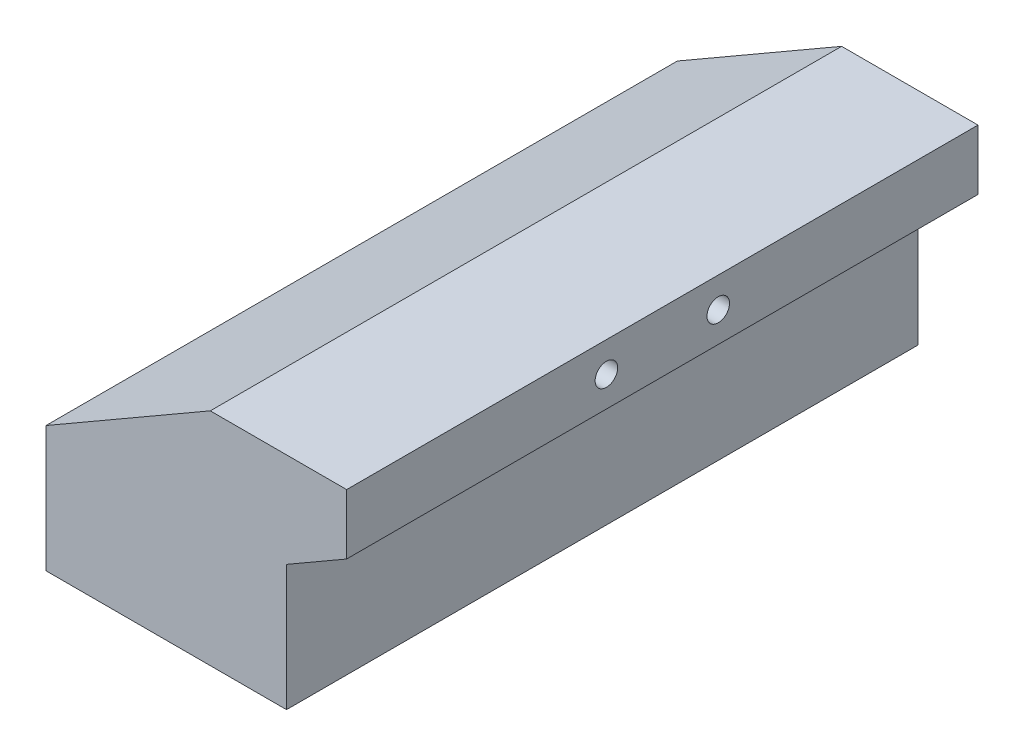
ISO-10303-21;
HEADER;
FILE_DESCRIPTION(('STEP AP214'),'2;1');
FILE_NAME('part.step','',(''),(''),'','','');
FILE_SCHEMA(('AUTOMOTIVE_DESIGN { 1 0 10303 214 1 1 1 1 }'));
ENDSEC;
DATA;
#1=APPLICATION_CONTEXT('core data for automotive mechanical design processes');
#2=APPLICATION_PROTOCOL_DEFINITION('international standard','automotive_design',2000,#1);
#3=PRODUCT_CONTEXT('',#1,'mechanical');
#4=PRODUCT('Part','Part','',(#3));
#5=PRODUCT_RELATED_PRODUCT_CATEGORY('part','',(#4));
#6=PRODUCT_DEFINITION_FORMATION('','',#4);
#7=PRODUCT_DEFINITION_CONTEXT('part definition',#1,'design');
#8=PRODUCT_DEFINITION('design','',#6,#7);
#9=PRODUCT_DEFINITION_SHAPE('','',#8);
#10=(LENGTH_UNIT() NAMED_UNIT(*) SI_UNIT(.MILLI.,.METRE.));
#11=(NAMED_UNIT(*) PLANE_ANGLE_UNIT() SI_UNIT($,.RADIAN.));
#12=(NAMED_UNIT(*) SI_UNIT($,.STERADIAN.) SOLID_ANGLE_UNIT());
#13=UNCERTAINTY_MEASURE_WITH_UNIT(LENGTH_MEASURE(1.E-05),#10,'distance_accuracy_value','');
#14=(GEOMETRIC_REPRESENTATION_CONTEXT(3) GLOBAL_UNCERTAINTY_ASSIGNED_CONTEXT((#13)) GLOBAL_UNIT_ASSIGNED_CONTEXT((#10,
#11,#12)) REPRESENTATION_CONTEXT('',''));
#15=CARTESIAN_POINT('',(0.,0.,0.));
#16=DIRECTION('',(0.,0.,1.));
#17=DIRECTION('',(1.,0.,0.));
#18=AXIS2_PLACEMENT_3D('',#15,#16,#17);
#19=CARTESIAN_POINT('',(31.75,0.,66.675));
#20=DIRECTION('',(0.,1.,0.));
#21=DIRECTION('',(0.,0.,1.));
#22=AXIS2_PLACEMENT_3D('',#19,#20,#21);
#23=PLANE('',#22);
#24=DIRECTION('',(1.,0.,0.));
#25=VECTOR('',#24,1.);
#26=CARTESIAN_POINT('',(31.75,0.,-66.675));
#27=LINE('',#26,#25);
#28=CARTESIAN_POINT('',(0.,0.,-66.675));
#29=VERTEX_POINT('',#28);
#30=CARTESIAN_POINT('',(50.8,0.,-66.675));
#31=VERTEX_POINT('',#30);
#32=EDGE_CURVE('E124',#29,#31,#27,.T.);
#33=ORIENTED_EDGE('',*,*,#32,.T.);
#34=DIRECTION('',(0.,0.,-1.));
#35=VECTOR('',#34,1.);
#36=CARTESIAN_POINT('',(50.8,0.,66.675));
#37=LINE('',#36,#35);
#38=CARTESIAN_POINT('',(50.8,0.,66.675));
#39=VERTEX_POINT('',#38);
#40=EDGE_CURVE('E11',#39,#31,#37,.T.);
#41=ORIENTED_EDGE('',*,*,#40,.F.);
#42=DIRECTION('',(1.,0.,0.));
#43=VECTOR('',#42,1.);
#44=CARTESIAN_POINT('',(31.75,0.,66.675));
#45=LINE('',#44,#43);
#46=CARTESIAN_POINT('',(0.,0.,66.675));
#47=VERTEX_POINT('',#46);
#48=EDGE_CURVE('E142',#47,#39,#45,.T.);
#49=ORIENTED_EDGE('',*,*,#48,.F.);
#50=DIRECTION('',(0.,0.,-1.));
#51=VECTOR('',#50,1.);
#52=CARTESIAN_POINT('',(0.,0.,66.675));
#53=LINE('',#52,#51);
#54=EDGE_CURVE('E49',#47,#29,#53,.T.);
#55=ORIENTED_EDGE('',*,*,#54,.T.);
#56=EDGE_LOOP('',(#33,#41,#49,#55));
#57=FACE_BOUND('',#56,.T.);
#58=ADVANCED_FACE('F33',(#57),#23,.F.);
#59=CARTESIAN_POINT('',(50.8,-38.1052865458276,66.675));
#60=DIRECTION('',(-1.,0.,0.));
#61=DIRECTION('',(0.,0.,1.));
#62=AXIS2_PLACEMENT_3D('',#59,#60,#61);
#63=PLANE('',#62);
#64=DIRECTION('',(0.,1.,0.));
#65=VECTOR('',#64,1.);
#66=CARTESIAN_POINT('',(50.8,-38.1052865458276,-66.675));
#67=LINE('',#66,#65);
#68=CARTESIAN_POINT('',(50.8,26.5766515812917,-66.675));
#69=VERTEX_POINT('',#68);
#70=EDGE_CURVE('E126',#31,#69,#67,.T.);
#71=ORIENTED_EDGE('',*,*,#70,.T.);
#72=DIRECTION('',(0.,0.,-1.));
#73=VECTOR('',#72,1.);
#74=CARTESIAN_POINT('',(50.8,26.5766515812917,66.675));
#75=LINE('',#74,#73);
#76=CARTESIAN_POINT('',(50.8,26.5766515812917,66.675));
#77=VERTEX_POINT('',#76);
#78=EDGE_CURVE('E41',#77,#69,#75,.T.);
#79=ORIENTED_EDGE('',*,*,#78,.F.);
#80=DIRECTION('',(0.,1.,0.));
#81=VECTOR('',#80,1.);
#82=CARTESIAN_POINT('',(50.8,-38.1052865458276,66.675));
#83=LINE('',#82,#81);
#84=EDGE_CURVE('E84',#39,#77,#83,.T.);
#85=ORIENTED_EDGE('',*,*,#84,.F.);
#86=ORIENTED_EDGE('',*,*,#40,.T.);
#87=EDGE_LOOP('',(#71,#79,#85,#86));
#88=FACE_BOUND('',#87,.T.);
#89=ADVANCED_FACE('F152',(#88),#63,.F.);
#90=CARTESIAN_POINT('',(8.50439920795068,2.15727507846499,66.675));
#91=DIRECTION('',(0.500000000000002,-0.866025403784438,0.));
#92=DIRECTION('',(0.866025403784438,0.500000000000002,0.));
#93=AXIS2_PLACEMENT_3D('',#90,#91,#92);
#94=PLANE('',#93);
#95=DIRECTION('',(-0.866025403784438,-0.500000000000002,0.));
#96=VECTOR('',#95,1.);
#97=CARTESIAN_POINT('',(8.50439920795068,2.15727507846499,-66.675));
#98=LINE('',#97,#96);
#99=CARTESIAN_POINT('',(63.5,33.909,-66.675));
#100=VERTEX_POINT('',#99);
#101=EDGE_CURVE('E130',#100,#69,#98,.T.);
#102=ORIENTED_EDGE('',*,*,#101,.F.);
#103=DIRECTION('',(0.,0.,-1.));
#104=VECTOR('',#103,1.);
#105=CARTESIAN_POINT('',(63.5,33.909,66.675));
#106=LINE('',#105,#104);
#107=CARTESIAN_POINT('',(63.5,33.909,66.675));
#108=VERTEX_POINT('',#107);
#109=EDGE_CURVE('E146',#108,#100,#106,.T.);
#110=ORIENTED_EDGE('',*,*,#109,.F.);
#111=DIRECTION('',(-0.866025403784438,-0.500000000000002,0.));
#112=VECTOR('',#111,1.);
#113=CARTESIAN_POINT('',(8.50439920795068,2.15727507846499,66.675));
#114=LINE('',#113,#112);
#115=EDGE_CURVE('E151',#108,#77,#114,.T.);
#116=ORIENTED_EDGE('',*,*,#115,.T.);
#117=ORIENTED_EDGE('',*,*,#78,.T.);
#118=EDGE_LOOP('',(#102,#110,#116,#117));
#119=FACE_BOUND('',#118,.T.);
#120=ADVANCED_FACE('F150',(#119),#94,.T.);
#121=CARTESIAN_POINT('',(63.5,-38.1052865458276,66.675));
#122=DIRECTION('',(1.,0.,0.));
#123=DIRECTION('',(0.,0.,-1.));
#124=AXIS2_PLACEMENT_3D('',#121,#122,#123);
#125=PLANE('',#124);
#126=CARTESIAN_POINT('',(63.5,40.259,-11.811));
#127=DIRECTION('',(1.,0.,0.));
#128=DIRECTION('',(0.,0.,-1.));
#129=AXIS2_PLACEMENT_3D('',#126,#127,#128);
#130=CIRCLE('',#129,2.38125);
#131=CARTESIAN_POINT('',(63.5,40.259,-14.19225));
#132=VERTEX_POINT('',#131);
#133=EDGE_CURVE('E169',#132,#132,#130,.T.);
#134=ORIENTED_EDGE('',*,*,#133,.F.);
#135=EDGE_LOOP('',(#134));
#136=FACE_BOUND('',#135,.T.);
#137=CARTESIAN_POINT('',(63.5,40.259,11.811));
#138=DIRECTION('',(1.,0.,0.));
#139=DIRECTION('',(0.,0.,-1.));
#140=AXIS2_PLACEMENT_3D('',#137,#138,#139);
#141=CIRCLE('',#140,2.38125);
#142=CARTESIAN_POINT('',(63.5,40.259,9.42975));
#143=VERTEX_POINT('',#142);
#144=EDGE_CURVE('E163',#143,#143,#141,.T.);
#145=ORIENTED_EDGE('',*,*,#144,.F.);
#146=EDGE_LOOP('',(#145));
#147=FACE_BOUND('',#146,.T.);
#148=DIRECTION('',(0.,-1.,0.));
#149=VECTOR('',#148,1.);
#150=CARTESIAN_POINT('',(63.5,-38.1052865458276,-66.675));
#151=LINE('',#150,#149);
#152=CARTESIAN_POINT('',(63.5,46.609,-66.675));
#153=VERTEX_POINT('',#152);
#154=EDGE_CURVE('E133',#153,#100,#151,.T.);
#155=ORIENTED_EDGE('',*,*,#154,.F.);
#156=DIRECTION('',(0.,0.,-1.));
#157=VECTOR('',#156,1.);
#158=CARTESIAN_POINT('',(63.5,46.609,66.675));
#159=LINE('',#158,#157);
#160=CARTESIAN_POINT('',(63.5,46.609,66.675));
#161=VERTEX_POINT('',#160);
#162=EDGE_CURVE('E106',#161,#153,#159,.T.);
#163=ORIENTED_EDGE('',*,*,#162,.F.);
#164=DIRECTION('',(0.,-1.,0.));
#165=VECTOR('',#164,1.);
#166=CARTESIAN_POINT('',(63.5,-38.1052865458276,66.675));
#167=LINE('',#166,#165);
#168=EDGE_CURVE('E116',#161,#108,#167,.T.);
#169=ORIENTED_EDGE('',*,*,#168,.T.);
#170=ORIENTED_EDGE('',*,*,#109,.T.);
#171=EDGE_LOOP('',(#155,#163,#169,#170));
#172=FACE_BOUND('',#171,.T.);
#173=ADVANCED_FACE('F158',(#136,#147,#172),#125,.T.);
#174=CARTESIAN_POINT('',(31.75,46.609,66.675));
#175=DIRECTION('',(0.,1.,0.));
#176=DIRECTION('',(0.,0.,1.));
#177=AXIS2_PLACEMENT_3D('',#174,#175,#176);
#178=PLANE('',#177);
#179=DIRECTION('',(1.,0.,0.));
#180=VECTOR('',#179,1.);
#181=CARTESIAN_POINT('',(31.75,46.609,-66.675));
#182=LINE('',#181,#180);
#183=CARTESIAN_POINT('',(34.6970452561247,46.609,-66.675));
#184=VERTEX_POINT('',#183);
#185=EDGE_CURVE('E102',#184,#153,#182,.T.);
#186=ORIENTED_EDGE('',*,*,#185,.F.);
#187=DIRECTION('',(0.,0.,-1.));
#188=VECTOR('',#187,1.);
#189=CARTESIAN_POINT('',(34.6970452561247,46.609,66.675));
#190=LINE('',#189,#188);
#191=CARTESIAN_POINT('',(34.6970452561247,46.609,66.675));
#192=VERTEX_POINT('',#191);
#193=EDGE_CURVE('E97',#192,#184,#190,.T.);
#194=ORIENTED_EDGE('',*,*,#193,.F.);
#195=DIRECTION('',(1.,0.,0.));
#196=VECTOR('',#195,1.);
#197=CARTESIAN_POINT('',(31.75,46.609,66.675));
#198=LINE('',#197,#196);
#199=EDGE_CURVE('E100',#192,#161,#198,.T.);
#200=ORIENTED_EDGE('',*,*,#199,.T.);
#201=ORIENTED_EDGE('',*,*,#162,.T.);
#202=EDGE_LOOP('',(#186,#194,#200,#201));
#203=FACE_BOUND('',#202,.T.);
#204=ADVANCED_FACE('F99',(#203),#178,.T.);
#205=CARTESIAN_POINT('',(-4.19560079204937,24.1543203345898,66.675));
#206=DIRECTION('',(-0.500000000000001,0.866025403784438,0.));
#207=DIRECTION('',(-0.866025403784438,-0.500000000000001,0.));
#208=AXIS2_PLACEMENT_3D('',#205,#206,#207);
#209=PLANE('',#208);
#210=DIRECTION('',(0.866025403784438,0.500000000000001,0.));
#211=VECTOR('',#210,1.);
#212=CARTESIAN_POINT('',(-4.19560079204937,24.1543203345898,-66.675));
#213=LINE('',#212,#211);
#214=CARTESIAN_POINT('',(0.,26.5766515812917,-66.675));
#215=VERTEX_POINT('',#214);
#216=EDGE_CURVE('E137',#215,#184,#213,.T.);
#217=ORIENTED_EDGE('',*,*,#216,.F.);
#218=DIRECTION('',(0.,0.,-1.));
#219=VECTOR('',#218,1.);
#220=CARTESIAN_POINT('',(0.,26.5766515812917,66.675));
#221=LINE('',#220,#219);
#222=CARTESIAN_POINT('',(0.,26.5766515812917,66.675));
#223=VERTEX_POINT('',#222);
#224=EDGE_CURVE('E72',#223,#215,#221,.T.);
#225=ORIENTED_EDGE('',*,*,#224,.F.);
#226=DIRECTION('',(0.866025403784438,0.500000000000001,0.));
#227=VECTOR('',#226,1.);
#228=CARTESIAN_POINT('',(-4.19560079204937,24.1543203345898,66.675));
#229=LINE('',#228,#227);
#230=EDGE_CURVE('E113',#223,#192,#229,.T.);
#231=ORIENTED_EDGE('',*,*,#230,.T.);
#232=ORIENTED_EDGE('',*,*,#193,.T.);
#233=EDGE_LOOP('',(#217,#225,#231,#232));
#234=FACE_BOUND('',#233,.T.);
#235=ADVANCED_FACE('F118',(#234),#209,.T.);
#236=CARTESIAN_POINT('',(0.,-38.1052865458276,66.675));
#237=DIRECTION('',(-1.,0.,0.));
#238=DIRECTION('',(0.,-1.,0.));
#239=AXIS2_PLACEMENT_3D('',#236,#237,#238);
#240=PLANE('',#239);
#241=DIRECTION('',(0.,1.,0.));
#242=VECTOR('',#241,1.);
#243=CARTESIAN_POINT('',(0.,-38.1052865458276,-66.675));
#244=LINE('',#243,#242);
#245=EDGE_CURVE('E139',#29,#215,#244,.T.);
#246=ORIENTED_EDGE('',*,*,#245,.F.);
#247=ORIENTED_EDGE('',*,*,#54,.F.);
#248=DIRECTION('',(0.,1.,0.));
#249=VECTOR('',#248,1.);
#250=CARTESIAN_POINT('',(0.,-38.1052865458276,66.675));
#251=LINE('',#250,#249);
#252=EDGE_CURVE('E119',#47,#223,#251,.T.);
#253=ORIENTED_EDGE('',*,*,#252,.T.);
#254=ORIENTED_EDGE('',*,*,#224,.T.);
#255=EDGE_LOOP('',(#246,#247,#253,#254));
#256=FACE_BOUND('',#255,.T.);
#257=ADVANCED_FACE('F206',(#256),#240,.T.);
#258=CARTESIAN_POINT('',(31.75,-38.1052865458276,66.675));
#259=DIRECTION('',(0.,0.,1.));
#260=DIRECTION('',(1.,0.,0.));
#261=AXIS2_PLACEMENT_3D('',#258,#259,#260);
#262=PLANE('',#261);
#263=ORIENTED_EDGE('',*,*,#48,.T.);
#264=ORIENTED_EDGE('',*,*,#84,.T.);
#265=ORIENTED_EDGE('',*,*,#115,.F.);
#266=ORIENTED_EDGE('',*,*,#168,.F.);
#267=ORIENTED_EDGE('',*,*,#199,.F.);
#268=ORIENTED_EDGE('',*,*,#230,.F.);
#269=ORIENTED_EDGE('',*,*,#252,.F.);
#270=EDGE_LOOP('',(#263,#264,#265,#266,#267,#268,#269));
#271=FACE_BOUND('',#270,.T.);
#272=ADVANCED_FACE('F111',(#271),#262,.T.);
#273=CARTESIAN_POINT('',(31.75,-38.1052865458276,-66.675));
#274=DIRECTION('',(0.,0.,1.));
#275=DIRECTION('',(1.,0.,0.));
#276=AXIS2_PLACEMENT_3D('',#273,#274,#275);
#277=PLANE('',#276);
#278=ORIENTED_EDGE('',*,*,#32,.F.);
#279=ORIENTED_EDGE('',*,*,#245,.T.);
#280=ORIENTED_EDGE('',*,*,#216,.T.);
#281=ORIENTED_EDGE('',*,*,#185,.T.);
#282=ORIENTED_EDGE('',*,*,#154,.T.);
#283=ORIENTED_EDGE('',*,*,#101,.T.);
#284=ORIENTED_EDGE('',*,*,#70,.F.);
#285=EDGE_LOOP('',(#278,#279,#280,#281,#282,#283,#284));
#286=FACE_BOUND('',#285,.T.);
#287=ADVANCED_FACE('F155',(#286),#277,.F.);
#288=CARTESIAN_POINT('',(53.975,40.259,11.811));
#289=DIRECTION('',(1.,0.,0.));
#290=DIRECTION('',(0.,0.,-1.));
#291=AXIS2_PLACEMENT_3D('',#288,#289,#290);
#292=CYLINDRICAL_SURFACE('',#291,2.38125);
#293=CARTESIAN_POINT('',(53.975,40.259,11.811));
#294=DIRECTION('',(1.,0.,0.));
#295=DIRECTION('',(0.,0.,-1.));
#296=AXIS2_PLACEMENT_3D('',#293,#294,#295);
#297=CIRCLE('',#296,2.38125);
#298=CARTESIAN_POINT('',(53.975,40.259,9.42975));
#299=VERTEX_POINT('',#298);
#300=EDGE_CURVE('E127',#299,#299,#297,.T.);
#301=ORIENTED_EDGE('',*,*,#300,.F.);
#302=EDGE_LOOP('',(#301));
#303=FACE_BOUND('',#302,.T.);
#304=ORIENTED_EDGE('',*,*,#144,.T.);
#305=EDGE_LOOP('',(#304));
#306=FACE_BOUND('',#305,.T.);
#307=ADVANCED_FACE('F189',(#303,#306),#292,.F.);
#308=CARTESIAN_POINT('',(53.975,40.259,11.811));
#309=DIRECTION('',(1.,0.,0.));
#310=DIRECTION('',(0.,0.,-1.));
#311=AXIS2_PLACEMENT_3D('',#308,#309,#310);
#312=PLANE('',#311);
#313=ORIENTED_EDGE('',*,*,#300,.T.);
#314=EDGE_LOOP('',(#313));
#315=FACE_BOUND('',#314,.T.);
#316=ADVANCED_FACE('F180',(#315),#312,.T.);
#317=CARTESIAN_POINT('',(53.975,40.259,-11.811));
#318=DIRECTION('',(1.,0.,0.));
#319=DIRECTION('',(0.,0.,-1.));
#320=AXIS2_PLACEMENT_3D('',#317,#318,#319);
#321=CYLINDRICAL_SURFACE('',#320,2.38125);
#322=CARTESIAN_POINT('',(53.975,40.259,-11.811));
#323=DIRECTION('',(1.,0.,0.));
#324=DIRECTION('',(0.,0.,-1.));
#325=AXIS2_PLACEMENT_3D('',#322,#323,#324);
#326=CIRCLE('',#325,2.38125);
#327=CARTESIAN_POINT('',(53.975,40.259,-14.19225));
#328=VERTEX_POINT('',#327);
#329=EDGE_CURVE('E166',#328,#328,#326,.T.);
#330=ORIENTED_EDGE('',*,*,#329,.F.);
#331=EDGE_LOOP('',(#330));
#332=FACE_BOUND('',#331,.T.);
#333=ORIENTED_EDGE('',*,*,#133,.T.);
#334=EDGE_LOOP('',(#333));
#335=FACE_BOUND('',#334,.T.);
#336=ADVANCED_FACE('F177',(#332,#335),#321,.F.);
#337=CARTESIAN_POINT('',(53.975,40.259,-11.811));
#338=DIRECTION('',(1.,0.,0.));
#339=DIRECTION('',(0.,0.,-1.));
#340=AXIS2_PLACEMENT_3D('',#337,#338,#339);
#341=PLANE('',#340);
#342=ORIENTED_EDGE('',*,*,#329,.T.);
#343=EDGE_LOOP('',(#342));
#344=FACE_BOUND('',#343,.T.);
#345=ADVANCED_FACE('F175',(#344),#341,.T.);
#346=CLOSED_SHELL('',(#58,#89,#120,#173,#204,#235,#257,#272,#287,#307,#316,#336,#345));
#347=MANIFOLD_SOLID_BREP('B2',#346);
#348=ADVANCED_BREP_SHAPE_REPRESENTATION('',(#18,#347),#14);
#349=SHAPE_DEFINITION_REPRESENTATION(#9,#348);
ENDSEC;
END-ISO-10303-21;
